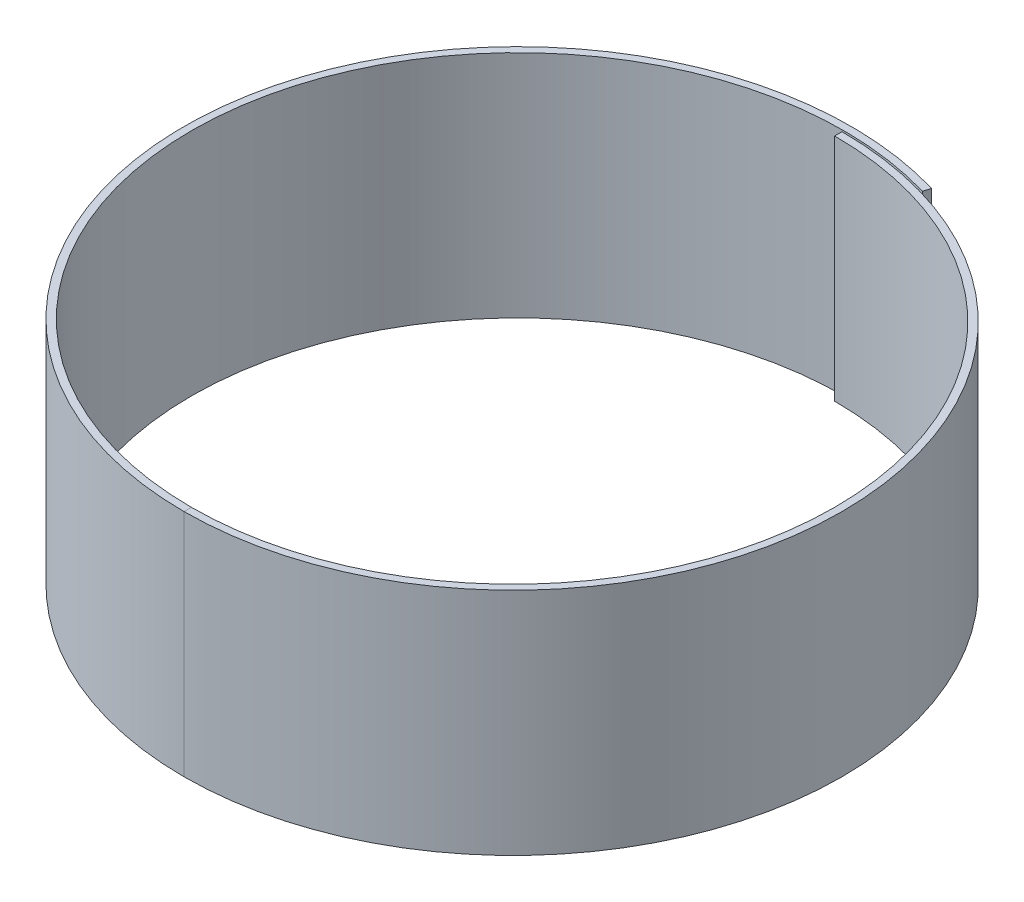
ISO-10303-21;
HEADER;
FILE_DESCRIPTION(('STEP AP214'),'2;1');
FILE_NAME('part.step','',(''),(''),'','','');
FILE_SCHEMA(('AUTOMOTIVE_DESIGN { 1 0 10303 214 1 1 1 1 }'));
ENDSEC;
DATA;
#1=APPLICATION_CONTEXT('core data for automotive mechanical design processes');
#2=APPLICATION_PROTOCOL_DEFINITION('international standard','automotive_design',2000,#1);
#3=PRODUCT_CONTEXT('',#1,'mechanical');
#4=PRODUCT('Part','Part','',(#3));
#5=PRODUCT_RELATED_PRODUCT_CATEGORY('part','',(#4));
#6=PRODUCT_DEFINITION_FORMATION('','',#4);
#7=PRODUCT_DEFINITION_CONTEXT('part definition',#1,'design');
#8=PRODUCT_DEFINITION('design','',#6,#7);
#9=PRODUCT_DEFINITION_SHAPE('','',#8);
#10=(LENGTH_UNIT() NAMED_UNIT(*) SI_UNIT(.MILLI.,.METRE.));
#11=(NAMED_UNIT(*) PLANE_ANGLE_UNIT() SI_UNIT($,.RADIAN.));
#12=(NAMED_UNIT(*) SI_UNIT($,.STERADIAN.) SOLID_ANGLE_UNIT());
#13=UNCERTAINTY_MEASURE_WITH_UNIT(LENGTH_MEASURE(1.E-05),#10,'distance_accuracy_value','');
#14=(GEOMETRIC_REPRESENTATION_CONTEXT(3) GLOBAL_UNCERTAINTY_ASSIGNED_CONTEXT((#13)) GLOBAL_UNIT_ASSIGNED_CONTEXT((#10,
#11,#12)) REPRESENTATION_CONTEXT('',''));
#15=CARTESIAN_POINT('',(0.,0.,0.));
#16=DIRECTION('',(0.,0.,1.));
#17=DIRECTION('',(1.,0.,0.));
#18=AXIS2_PLACEMENT_3D('',#15,#16,#17);
#19=CARTESIAN_POINT('',(0.,25.,36.3000000000001));
#20=DIRECTION('',(0.,1.,0.));
#21=DIRECTION('',(0.,0.,1.));
#22=AXIS2_PLACEMENT_3D('',#19,#20,#21);
#23=PLANE('',#22);
#24=DIRECTION('',(0.,0.,-1.));
#25=VECTOR('',#24,1.);
#26=CARTESIAN_POINT('',(0.,25.,36.3000000000001));
#27=LINE('',#26,#25);
#28=CARTESIAN_POINT('',(0.,25.,36.3000000000001));
#29=VERTEX_POINT('',#28);
#30=CARTESIAN_POINT('',(0.,25.,35.5000000000001));
#31=VERTEX_POINT('',#30);
#32=EDGE_CURVE('E11',#29,#31,#27,.T.);
#33=ORIENTED_EDGE('',*,*,#32,.F.);
#34=CARTESIAN_POINT('',(0.,25.,0.5));
#35=DIRECTION('',(0.,1.,0.));
#36=DIRECTION('',(1.,0.,0.));
#37=AXIS2_PLACEMENT_3D('',#34,#35,#36);
#38=CIRCLE('',#37,35.8000000000001);
#39=CARTESIAN_POINT('',(0.,25.,-35.3000000000001));
#40=VERTEX_POINT('',#39);
#41=EDGE_CURVE('E84',#29,#40,#38,.T.);
#42=ORIENTED_EDGE('',*,*,#41,.T.);
#43=DIRECTION('',(0.,0.,-1.));
#44=VECTOR('',#43,1.);
#45=CARTESIAN_POINT('',(0.,25.,-34.5000000000001));
#46=LINE('',#45,#44);
#47=CARTESIAN_POINT('',(0.,25.,-34.5000000000001));
#48=VERTEX_POINT('',#47);
#49=EDGE_CURVE('E145',#48,#40,#46,.T.);
#50=ORIENTED_EDGE('',*,*,#49,.F.);
#51=CARTESIAN_POINT('',(0.,25.,0.5));
#52=DIRECTION('',(0.,1.,0.));
#53=DIRECTION('',(0.,0.,1.));
#54=AXIS2_PLACEMENT_3D('',#51,#52,#53);
#55=CIRCLE('',#54,35.0000000000001);
#56=EDGE_CURVE('E111',#31,#48,#55,.T.);
#57=ORIENTED_EDGE('',*,*,#56,.F.);
#58=EDGE_LOOP('',(#33,#42,#50,#57));
#59=FACE_BOUND('',#58,.T.);
#60=ADVANCED_FACE('F37',(#59),#23,.T.);
#61=CARTESIAN_POINT('',(0.,0.,35.5000000000001));
#62=DIRECTION('',(0.,-1.,0.));
#63=DIRECTION('',(0.,0.,-1.));
#64=AXIS2_PLACEMENT_3D('',#61,#62,#63);
#65=PLANE('',#64);
#66=DIRECTION('',(0.,0.,1.));
#67=VECTOR('',#66,1.);
#68=CARTESIAN_POINT('',(0.,0.,35.5000000000001));
#69=LINE('',#68,#67);
#70=CARTESIAN_POINT('',(0.,0.,35.5000000000001));
#71=VERTEX_POINT('',#70);
#72=CARTESIAN_POINT('',(0.,0.,36.3000000000001));
#73=VERTEX_POINT('',#72);
#74=EDGE_CURVE('E45',#71,#73,#69,.T.);
#75=ORIENTED_EDGE('',*,*,#74,.F.);
#76=CARTESIAN_POINT('',(0.,0.,0.5));
#77=DIRECTION('',(0.,1.,0.));
#78=DIRECTION('',(0.,0.,1.));
#79=AXIS2_PLACEMENT_3D('',#76,#77,#78);
#80=CIRCLE('',#79,35.0000000000001);
#81=CARTESIAN_POINT('',(0.,0.,-34.5000000000001));
#82=VERTEX_POINT('',#81);
#83=EDGE_CURVE('E126',#71,#82,#80,.T.);
#84=ORIENTED_EDGE('',*,*,#83,.T.);
#85=DIRECTION('',(0.,0.,-1.));
#86=VECTOR('',#85,1.);
#87=CARTESIAN_POINT('',(0.,0.,-34.5000000000001));
#88=LINE('',#87,#86);
#89=CARTESIAN_POINT('',(0.,0.,-35.3000000000001));
#90=VERTEX_POINT('',#89);
#91=EDGE_CURVE('E123',#82,#90,#88,.T.);
#92=ORIENTED_EDGE('',*,*,#91,.T.);
#93=CARTESIAN_POINT('',(0.,0.,0.5));
#94=DIRECTION('',(0.,1.,0.));
#95=DIRECTION('',(1.,0.,0.));
#96=AXIS2_PLACEMENT_3D('',#93,#94,#95);
#97=CIRCLE('',#96,35.8000000000001);
#98=EDGE_CURVE('E120',#73,#90,#97,.T.);
#99=ORIENTED_EDGE('',*,*,#98,.F.);
#100=EDGE_LOOP('',(#75,#84,#92,#99));
#101=FACE_BOUND('',#100,.T.);
#102=ADVANCED_FACE('F151',(#101),#65,.T.);
#103=CARTESIAN_POINT('',(0.,25.,0.5));
#104=DIRECTION('',(0.,-1.,0.));
#105=DIRECTION('',(0.,0.,-1.));
#106=AXIS2_PLACEMENT_3D('',#103,#104,#105);
#107=CYLINDRICAL_SURFACE('',#106,35.8000000000001);
#108=ORIENTED_EDGE('',*,*,#98,.T.);
#109=DIRECTION('',(0.,-1.,0.));
#110=VECTOR('',#109,1.);
#111=CARTESIAN_POINT('',(0.,25.,-35.3000000000001));
#112=LINE('',#111,#110);
#113=EDGE_CURVE('E140',#40,#90,#112,.T.);
#114=ORIENTED_EDGE('',*,*,#113,.F.);
#115=ORIENTED_EDGE('',*,*,#41,.F.);
#116=DIRECTION('',(0.,-1.,0.));
#117=VECTOR('',#116,1.);
#118=CARTESIAN_POINT('',(0.,25.,36.3000000000001));
#119=LINE('',#118,#117);
#120=EDGE_CURVE('E116',#29,#73,#119,.T.);
#121=ORIENTED_EDGE('',*,*,#120,.T.);
#122=EDGE_LOOP('',(#108,#114,#115,#121));
#123=FACE_BOUND('',#122,.T.);
#124=ADVANCED_FACE('F148',(#123),#107,.T.);
#125=CARTESIAN_POINT('',(0.,25.,-34.5000000000001));
#126=DIRECTION('',(-1.,0.,0.));
#127=DIRECTION('',(0.,0.,1.));
#128=AXIS2_PLACEMENT_3D('',#125,#126,#127);
#129=PLANE('',#128);
#130=ORIENTED_EDGE('',*,*,#91,.F.);
#131=DIRECTION('',(0.,-1.,0.));
#132=VECTOR('',#131,1.);
#133=CARTESIAN_POINT('',(0.,25.,-34.5000000000001));
#134=LINE('',#133,#132);
#135=EDGE_CURVE('E138',#48,#82,#134,.T.);
#136=ORIENTED_EDGE('',*,*,#135,.F.);
#137=ORIENTED_EDGE('',*,*,#49,.T.);
#138=ORIENTED_EDGE('',*,*,#113,.T.);
#139=EDGE_LOOP('',(#130,#136,#137,#138));
#140=FACE_BOUND('',#139,.T.);
#141=ADVANCED_FACE('F144',(#140),#129,.T.);
#142=CARTESIAN_POINT('',(0.,25.,0.5));
#143=DIRECTION('',(0.,-1.,0.));
#144=DIRECTION('',(0.,0.,-1.));
#145=AXIS2_PLACEMENT_3D('',#142,#143,#144);
#146=CYLINDRICAL_SURFACE('',#145,35.0000000000001);
#147=ORIENTED_EDGE('',*,*,#83,.F.);
#148=DIRECTION('',(0.,-1.,0.));
#149=VECTOR('',#148,1.);
#150=CARTESIAN_POINT('',(0.,25.,35.5000000000001));
#151=LINE('',#150,#149);
#152=EDGE_CURVE('E104',#31,#71,#151,.T.);
#153=ORIENTED_EDGE('',*,*,#152,.F.);
#154=ORIENTED_EDGE('',*,*,#56,.T.);
#155=ORIENTED_EDGE('',*,*,#135,.T.);
#156=EDGE_LOOP('',(#147,#153,#154,#155));
#157=FACE_BOUND('',#156,.T.);
#158=ADVANCED_FACE('F154',(#157),#146,.F.);
#159=CARTESIAN_POINT('',(0.,25.,0.));
#160=DIRECTION('',(0.,-1.,0.));
#161=DIRECTION('',(0.,0.,-1.));
#162=AXIS2_PLACEMENT_3D('',#159,#160,#161);
#163=CYLINDRICAL_SURFACE('',#162,35.5000000000001);
#164=CARTESIAN_POINT('',(0.,0.,0.));
#165=DIRECTION('',(0.,1.,0.));
#166=DIRECTION('',(0.,0.,1.));
#167=AXIS2_PLACEMENT_3D('',#164,#165,#166);
#168=CIRCLE('',#167,35.5000000000001);
#169=CARTESIAN_POINT('',(9.99054373310964,0.,-34.0652173913044));
#170=VERTEX_POINT('',#169);
#171=EDGE_CURVE('E99',#170,#71,#168,.T.);
#172=ORIENTED_EDGE('',*,*,#171,.F.);
#173=DIRECTION('',(0.,-1.,0.));
#174=VECTOR('',#173,1.);
#175=CARTESIAN_POINT('',(9.99054373310964,25.,-34.0652173913044));
#176=LINE('',#175,#174);
#177=CARTESIAN_POINT('',(9.99054373310964,25.,-34.0652173913044));
#178=VERTEX_POINT('',#177);
#179=EDGE_CURVE('E94',#178,#170,#176,.T.);
#180=ORIENTED_EDGE('',*,*,#179,.F.);
#181=CARTESIAN_POINT('',(0.,25.,0.));
#182=DIRECTION('',(0.,1.,0.));
#183=DIRECTION('',(0.,0.,1.));
#184=AXIS2_PLACEMENT_3D('',#181,#182,#183);
#185=CIRCLE('',#184,35.5000000000001);
#186=EDGE_CURVE('E98',#178,#31,#185,.T.);
#187=ORIENTED_EDGE('',*,*,#186,.T.);
#188=ORIENTED_EDGE('',*,*,#152,.T.);
#189=EDGE_LOOP('',(#172,#180,#187,#188));
#190=FACE_BOUND('',#189,.T.);
#191=ADVANCED_FACE('F96',(#190),#163,.F.);
#192=CARTESIAN_POINT('',(10.2156827468135,25.,-34.8328842620944));
#193=DIRECTION('',(0.959583588487447,0.,0.281423767129848));
#194=DIRECTION('',(0.281423767129848,0.,-0.959583588487447));
#195=AXIS2_PLACEMENT_3D('',#192,#193,#194);
#196=PLANE('',#195);
#197=DIRECTION('',(-0.281423767129848,0.,0.959583588487446));
#198=VECTOR('',#197,1.);
#199=CARTESIAN_POINT('',(10.2156827468135,0.,-34.8328842620944));
#200=LINE('',#199,#198);
#201=CARTESIAN_POINT('',(10.2156827468135,0.,-34.8328842620944));
#202=VERTEX_POINT('',#201);
#203=EDGE_CURVE('E130',#202,#170,#200,.T.);
#204=ORIENTED_EDGE('',*,*,#203,.F.);
#205=DIRECTION('',(0.,-1.,0.));
#206=VECTOR('',#205,1.);
#207=CARTESIAN_POINT('',(10.2156827468135,25.,-34.8328842620944));
#208=LINE('',#207,#206);
#209=CARTESIAN_POINT('',(10.2156827468135,25.,-34.8328842620944));
#210=VERTEX_POINT('',#209);
#211=EDGE_CURVE('E74',#210,#202,#208,.T.);
#212=ORIENTED_EDGE('',*,*,#211,.F.);
#213=DIRECTION('',(-0.281423767129848,0.,0.959583588487446));
#214=VECTOR('',#213,1.);
#215=CARTESIAN_POINT('',(10.2156827468135,25.,-34.8328842620944));
#216=LINE('',#215,#214);
#217=EDGE_CURVE('E109',#210,#178,#216,.T.);
#218=ORIENTED_EDGE('',*,*,#217,.T.);
#219=ORIENTED_EDGE('',*,*,#179,.T.);
#220=EDGE_LOOP('',(#204,#212,#218,#219));
#221=FACE_BOUND('',#220,.T.);
#222=ADVANCED_FACE('F113',(#221),#196,.T.);
#223=CARTESIAN_POINT('',(0.,25.,0.));
#224=DIRECTION('',(0.,-1.,0.));
#225=DIRECTION('',(0.,0.,-1.));
#226=AXIS2_PLACEMENT_3D('',#223,#224,#225);
#227=CYLINDRICAL_SURFACE('',#226,36.3000000000001);
#228=CARTESIAN_POINT('',(0.,0.,0.));
#229=DIRECTION('',(0.,1.,0.));
#230=DIRECTION('',(1.,0.,0.));
#231=AXIS2_PLACEMENT_3D('',#228,#229,#230);
#232=CIRCLE('',#231,36.3000000000001);
#233=EDGE_CURVE('E132',#202,#73,#232,.T.);
#234=ORIENTED_EDGE('',*,*,#233,.T.);
#235=ORIENTED_EDGE('',*,*,#120,.F.);
#236=CARTESIAN_POINT('',(0.,25.,0.));
#237=DIRECTION('',(0.,1.,0.));
#238=DIRECTION('',(1.,0.,0.));
#239=AXIS2_PLACEMENT_3D('',#236,#237,#238);
#240=CIRCLE('',#239,36.3000000000001);
#241=EDGE_CURVE('E114',#210,#29,#240,.T.);
#242=ORIENTED_EDGE('',*,*,#241,.F.);
#243=ORIENTED_EDGE('',*,*,#211,.T.);
#244=EDGE_LOOP('',(#234,#235,#242,#243));
#245=FACE_BOUND('',#244,.T.);
#246=ADVANCED_FACE('F157',(#245),#227,.T.);
#247=CARTESIAN_POINT('',(0.,25.,0.5));
#248=DIRECTION('',(0.,1.,0.));
#249=DIRECTION('',(1.,0.,0.));
#250=AXIS2_PLACEMENT_3D('',#247,#248,#249);
#251=PLANE('',#250);
#252=ORIENTED_EDGE('',*,*,#241,.T.);
#253=ORIENTED_EDGE('',*,*,#32,.T.);
#254=ORIENTED_EDGE('',*,*,#186,.F.);
#255=ORIENTED_EDGE('',*,*,#217,.F.);
#256=EDGE_LOOP('',(#252,#253,#254,#255));
#257=FACE_BOUND('',#256,.T.);
#258=ADVANCED_FACE('F108',(#257),#251,.T.);
#259=CARTESIAN_POINT('',(0.,0.,0.5));
#260=DIRECTION('',(0.,1.,0.));
#261=DIRECTION('',(1.,0.,0.));
#262=AXIS2_PLACEMENT_3D('',#259,#260,#261);
#263=PLANE('',#262);
#264=ORIENTED_EDGE('',*,*,#171,.T.);
#265=ORIENTED_EDGE('',*,*,#74,.T.);
#266=ORIENTED_EDGE('',*,*,#233,.F.);
#267=ORIENTED_EDGE('',*,*,#203,.T.);
#268=EDGE_LOOP('',(#264,#265,#266,#267));
#269=FACE_BOUND('',#268,.T.);
#270=ADVANCED_FACE('F156',(#269),#263,.F.);
#271=CLOSED_SHELL('',(#60,#102,#124,#141,#158,#191,#222,#246,#258,#270));
#272=MANIFOLD_SOLID_BREP('B2',#271);
#273=ADVANCED_BREP_SHAPE_REPRESENTATION('',(#18,#272),#14);
#274=SHAPE_DEFINITION_REPRESENTATION(#9,#273);
ENDSEC;
END-ISO-10303-21;
